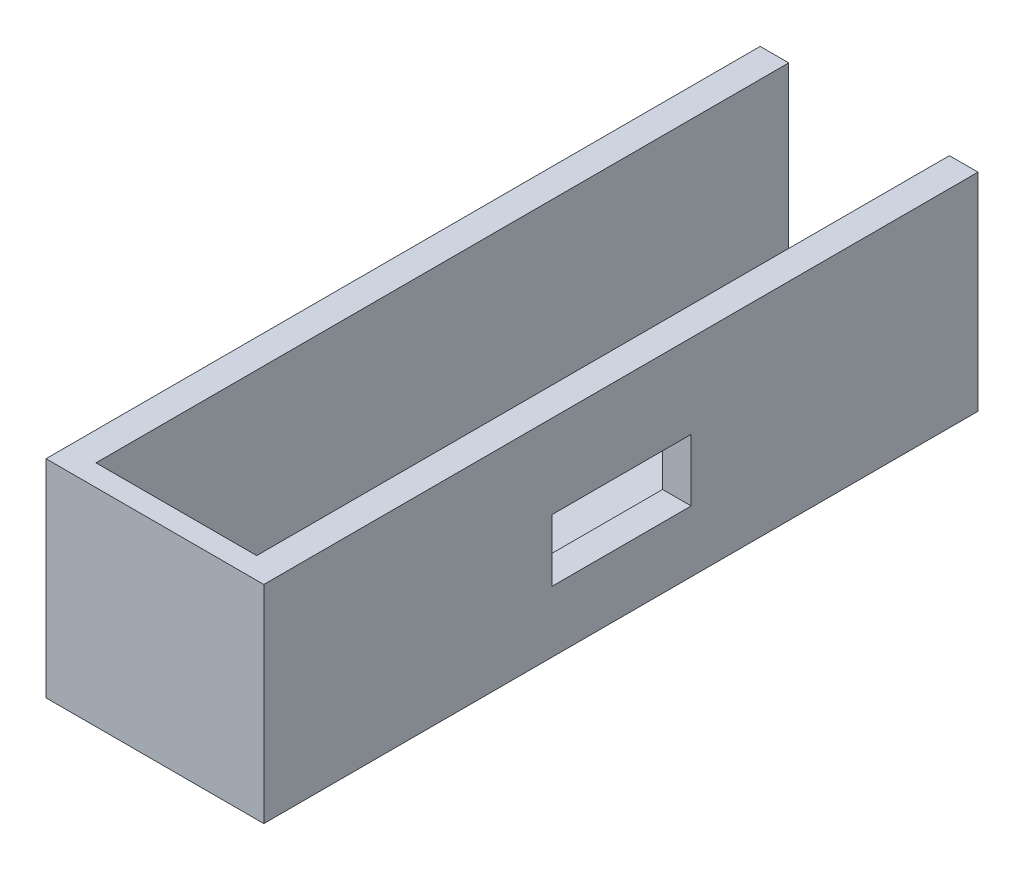
ISO-10303-21;
HEADER;
FILE_DESCRIPTION(('STEP AP214'),'2;1');
FILE_NAME('part.step','',(''),(''),'','','');
FILE_SCHEMA(('AUTOMOTIVE_DESIGN { 1 0 10303 214 1 1 1 1 }'));
ENDSEC;
DATA;
#1=APPLICATION_CONTEXT('core data for automotive mechanical design processes');
#2=APPLICATION_PROTOCOL_DEFINITION('international standard','automotive_design',2000,#1);
#3=PRODUCT_CONTEXT('',#1,'mechanical');
#4=PRODUCT('Part','Part','',(#3));
#5=PRODUCT_RELATED_PRODUCT_CATEGORY('part','',(#4));
#6=PRODUCT_DEFINITION_FORMATION('','',#4);
#7=PRODUCT_DEFINITION_CONTEXT('part definition',#1,'design');
#8=PRODUCT_DEFINITION('design','',#6,#7);
#9=PRODUCT_DEFINITION_SHAPE('','',#8);
#10=(LENGTH_UNIT() NAMED_UNIT(*) SI_UNIT(.MILLI.,.METRE.));
#11=(NAMED_UNIT(*) PLANE_ANGLE_UNIT() SI_UNIT($,.RADIAN.));
#12=(NAMED_UNIT(*) SI_UNIT($,.STERADIAN.) SOLID_ANGLE_UNIT());
#13=UNCERTAINTY_MEASURE_WITH_UNIT(LENGTH_MEASURE(1.E-05),#10,'distance_accuracy_value','');
#14=(GEOMETRIC_REPRESENTATION_CONTEXT(3) GLOBAL_UNCERTAINTY_ASSIGNED_CONTEXT((#13)) GLOBAL_UNIT_ASSIGNED_CONTEXT((#10,
#11,#12)) REPRESENTATION_CONTEXT('',''));
#15=CARTESIAN_POINT('',(0.,0.,0.));
#16=DIRECTION('',(0.,0.,1.));
#17=DIRECTION('',(1.,0.,0.));
#18=AXIS2_PLACEMENT_3D('',#15,#16,#17);
#19=CARTESIAN_POINT('',(12.6513513513514,-25.,50.));
#20=DIRECTION('',(1.,0.,0.));
#21=DIRECTION('',(0.,0.,-1.));
#22=AXIS2_PLACEMENT_3D('',#19,#20,#21);
#23=PLANE('',#22);
#24=DIRECTION('',(0.,-1.,0.));
#25=VECTOR('',#24,1.);
#26=CARTESIAN_POINT('',(12.6513513513514,-25.,47.));
#27=LINE('',#26,#25);
#28=CARTESIAN_POINT('',(12.6513513513514,0.,47.));
#29=VERTEX_POINT('',#28);
#30=CARTESIAN_POINT('',(12.6513513513514,-25.,47.));
#31=VERTEX_POINT('',#30);
#32=EDGE_CURVE('E185',#29,#31,#27,.T.);
#33=ORIENTED_EDGE('',*,*,#32,.F.);
#34=DIRECTION('',(0.,0.,-1.));
#35=VECTOR('',#34,1.);
#36=CARTESIAN_POINT('',(12.6513513513514,0.,50.));
#37=LINE('',#36,#35);
#38=CARTESIAN_POINT('',(12.6513513513514,0.,-50.));
#39=VERTEX_POINT('',#38);
#40=EDGE_CURVE('E151',#29,#39,#37,.T.);
#41=ORIENTED_EDGE('',*,*,#40,.T.);
#42=DIRECTION('',(0.,-1.,0.));
#43=VECTOR('',#42,1.);
#44=CARTESIAN_POINT('',(12.6513513513514,-25.,-50.));
#45=LINE('',#44,#43);
#46=CARTESIAN_POINT('',(12.6513513513514,-25.,-50.));
#47=VERTEX_POINT('',#46);
#48=EDGE_CURVE('E167',#39,#47,#45,.T.);
#49=ORIENTED_EDGE('',*,*,#48,.T.);
#50=DIRECTION('',(0.,0.,-1.));
#51=VECTOR('',#50,1.);
#52=CARTESIAN_POINT('',(12.6513513513514,-25.,50.));
#53=LINE('',#52,#51);
#54=EDGE_CURVE('E153',#31,#47,#53,.T.);
#55=ORIENTED_EDGE('',*,*,#54,.F.);
#56=EDGE_LOOP('',(#33,#41,#49,#55));
#57=FACE_BOUND('',#56,.T.);
#58=DIRECTION('',(0.,-1.,0.));
#59=VECTOR('',#58,1.);
#60=CARTESIAN_POINT('',(12.6513513513514,-25.,-9.83877827761877));
#61=LINE('',#60,#59);
#62=CARTESIAN_POINT('',(12.6513513513514,-11.7079955572935,-9.83877827761876));
#63=VERTEX_POINT('',#62);
#64=CARTESIAN_POINT('',(12.6513513513514,-20.3979955572935,-9.83877827761876));
#65=VERTEX_POINT('',#64);
#66=EDGE_CURVE('E132',#63,#65,#61,.T.);
#67=ORIENTED_EDGE('',*,*,#66,.F.);
#68=DIRECTION('',(0.,0.,-1.));
#69=VECTOR('',#68,1.);
#70=CARTESIAN_POINT('',(12.6513513513514,-11.7079955572935,50.));
#71=LINE('',#70,#69);
#72=CARTESIAN_POINT('',(12.6513513513514,-11.7079955572935,9.66122172238124));
#73=VERTEX_POINT('',#72);
#74=EDGE_CURVE('E201',#73,#63,#71,.T.);
#75=ORIENTED_EDGE('',*,*,#74,.F.);
#76=DIRECTION('',(0.,1.,0.));
#77=VECTOR('',#76,1.);
#78=CARTESIAN_POINT('',(12.6513513513514,-25.,9.66122172238124));
#79=LINE('',#78,#77);
#80=CARTESIAN_POINT('',(12.6513513513514,-20.3979955572935,9.66122172238124));
#81=VERTEX_POINT('',#80);
#82=EDGE_CURVE('E203',#81,#73,#79,.T.);
#83=ORIENTED_EDGE('',*,*,#82,.F.);
#84=DIRECTION('',(0.,0.,1.));
#85=VECTOR('',#84,1.);
#86=CARTESIAN_POINT('',(12.6513513513514,-20.3979955572935,50.));
#87=LINE('',#86,#85);
#88=EDGE_CURVE('E205',#65,#81,#87,.T.);
#89=ORIENTED_EDGE('',*,*,#88,.F.);
#90=EDGE_LOOP('',(#67,#75,#83,#89));
#91=FACE_BOUND('',#90,.T.);
#92=ADVANCED_FACE('F34',(#57,#91),#23,.F.);
#93=CARTESIAN_POINT('',(16.6513513513514,0.,50.));
#94=DIRECTION('',(-1.,0.,0.));
#95=DIRECTION('',(0.,-1.,0.));
#96=AXIS2_PLACEMENT_3D('',#93,#94,#95);
#97=PLANE('',#96);
#98=DIRECTION('',(0.,0.,-1.));
#99=VECTOR('',#98,1.);
#100=CARTESIAN_POINT('',(16.6513513513514,-29.,50.));
#101=LINE('',#100,#99);
#102=CARTESIAN_POINT('',(16.6513513513514,-29.,50.));
#103=VERTEX_POINT('',#102);
#104=CARTESIAN_POINT('',(16.6513513513514,-29.,-50.));
#105=VERTEX_POINT('',#104);
#106=EDGE_CURVE('E147',#103,#105,#101,.T.);
#107=ORIENTED_EDGE('',*,*,#106,.T.);
#108=DIRECTION('',(0.,1.,0.));
#109=VECTOR('',#108,1.);
#110=CARTESIAN_POINT('',(16.6513513513514,0.,-50.));
#111=LINE('',#110,#109);
#112=CARTESIAN_POINT('',(16.6513513513514,0.,-50.));
#113=VERTEX_POINT('',#112);
#114=EDGE_CURVE('E173',#105,#113,#111,.T.);
#115=ORIENTED_EDGE('',*,*,#114,.T.);
#116=DIRECTION('',(0.,0.,-1.));
#117=VECTOR('',#116,1.);
#118=CARTESIAN_POINT('',(16.6513513513514,0.,50.));
#119=LINE('',#118,#117);
#120=CARTESIAN_POINT('',(16.6513513513514,0.,50.));
#121=VERTEX_POINT('',#120);
#122=EDGE_CURVE('E149',#121,#113,#119,.T.);
#123=ORIENTED_EDGE('',*,*,#122,.F.);
#124=DIRECTION('',(0.,1.,0.));
#125=VECTOR('',#124,1.);
#126=CARTESIAN_POINT('',(16.6513513513514,0.,50.));
#127=LINE('',#126,#125);
#128=EDGE_CURVE('E159',#103,#121,#127,.T.);
#129=ORIENTED_EDGE('',*,*,#128,.F.);
#130=EDGE_LOOP('',(#107,#115,#123,#129));
#131=FACE_BOUND('',#130,.T.);
#132=DIRECTION('',(0.,1.,0.));
#133=VECTOR('',#132,1.);
#134=CARTESIAN_POINT('',(16.6513513513514,0.,-9.83877827761877));
#135=LINE('',#134,#133);
#136=CARTESIAN_POINT('',(16.6513513513514,-20.3979955572935,-9.83877827761876));
#137=VERTEX_POINT('',#136);
#138=CARTESIAN_POINT('',(16.6513513513514,-11.7079955572935,-9.83877827761876));
#139=VERTEX_POINT('',#138);
#140=EDGE_CURVE('E11',#137,#139,#135,.T.);
#141=ORIENTED_EDGE('',*,*,#140,.F.);
#142=DIRECTION('',(0.,0.,-1.));
#143=VECTOR('',#142,1.);
#144=CARTESIAN_POINT('',(16.6513513513514,-20.3979955572935,50.));
#145=LINE('',#144,#143);
#146=CARTESIAN_POINT('',(16.6513513513514,-20.3979955572935,9.66122172238124));
#147=VERTEX_POINT('',#146);
#148=EDGE_CURVE('E119',#147,#137,#145,.T.);
#149=ORIENTED_EDGE('',*,*,#148,.F.);
#150=DIRECTION('',(0.,-1.,0.));
#151=VECTOR('',#150,1.);
#152=CARTESIAN_POINT('',(16.6513513513514,0.,9.66122172238124));
#153=LINE('',#152,#151);
#154=CARTESIAN_POINT('',(16.6513513513514,-11.7079955572935,9.66122172238124));
#155=VERTEX_POINT('',#154);
#156=EDGE_CURVE('E124',#155,#147,#153,.T.);
#157=ORIENTED_EDGE('',*,*,#156,.F.);
#158=DIRECTION('',(0.,0.,1.));
#159=VECTOR('',#158,1.);
#160=CARTESIAN_POINT('',(16.6513513513514,-11.7079955572935,50.));
#161=LINE('',#160,#159);
#162=EDGE_CURVE('E42',#139,#155,#161,.T.);
#163=ORIENTED_EDGE('',*,*,#162,.F.);
#164=EDGE_LOOP('',(#141,#149,#157,#163));
#165=FACE_BOUND('',#164,.T.);
#166=ADVANCED_FACE('F136',(#131,#165),#97,.F.);
#167=CARTESIAN_POINT('',(-9.84864864864863,-25.,50.));
#168=DIRECTION('',(0.,-1.,0.));
#169=DIRECTION('',(0.,0.,-1.));
#170=AXIS2_PLACEMENT_3D('',#167,#168,#169);
#171=PLANE('',#170);
#172=DIRECTION('',(-1.,0.,0.));
#173=VECTOR('',#172,1.);
#174=CARTESIAN_POINT('',(-9.84864864864863,-25.,47.));
#175=LINE('',#174,#173);
#176=CARTESIAN_POINT('',(-9.84864864864863,-25.,47.));
#177=VERTEX_POINT('',#176);
#178=EDGE_CURVE('E195',#31,#177,#175,.T.);
#179=ORIENTED_EDGE('',*,*,#178,.F.);
#180=ORIENTED_EDGE('',*,*,#54,.T.);
#181=DIRECTION('',(-1.,0.,0.));
#182=VECTOR('',#181,1.);
#183=CARTESIAN_POINT('',(-9.84864864864863,-25.,-50.));
#184=LINE('',#183,#182);
#185=CARTESIAN_POINT('',(-9.84864864864863,-25.,-50.));
#186=VERTEX_POINT('',#185);
#187=EDGE_CURVE('E164',#47,#186,#184,.T.);
#188=ORIENTED_EDGE('',*,*,#187,.T.);
#189=DIRECTION('',(0.,0.,-1.));
#190=VECTOR('',#189,1.);
#191=CARTESIAN_POINT('',(-9.84864864864863,-25.,50.));
#192=LINE('',#191,#190);
#193=EDGE_CURVE('E155',#177,#186,#192,.T.);
#194=ORIENTED_EDGE('',*,*,#193,.F.);
#195=EDGE_LOOP('',(#179,#180,#188,#194));
#196=FACE_BOUND('',#195,.T.);
#197=ADVANCED_FACE('F232',(#196),#171,.F.);
#198=CARTESIAN_POINT('',(-9.84864864864864,0.,50.));
#199=DIRECTION('',(-1.,0.,0.));
#200=DIRECTION('',(0.,-1.,0.));
#201=AXIS2_PLACEMENT_3D('',#198,#199,#200);
#202=PLANE('',#201);
#203=DIRECTION('',(0.,1.,0.));
#204=VECTOR('',#203,1.);
#205=CARTESIAN_POINT('',(-9.84864864864864,0.,47.));
#206=LINE('',#205,#204);
#207=CARTESIAN_POINT('',(-9.84864864864864,0.,47.));
#208=VERTEX_POINT('',#207);
#209=EDGE_CURVE('E125',#177,#208,#206,.T.);
#210=ORIENTED_EDGE('',*,*,#209,.F.);
#211=ORIENTED_EDGE('',*,*,#193,.T.);
#212=DIRECTION('',(0.,1.,0.));
#213=VECTOR('',#212,1.);
#214=CARTESIAN_POINT('',(-9.84864864864864,0.,-50.));
#215=LINE('',#214,#213);
#216=CARTESIAN_POINT('',(-9.84864864864864,0.,-50.));
#217=VERTEX_POINT('',#216);
#218=EDGE_CURVE('E160',#186,#217,#215,.T.);
#219=ORIENTED_EDGE('',*,*,#218,.T.);
#220=DIRECTION('',(0.,0.,-1.));
#221=VECTOR('',#220,1.);
#222=CARTESIAN_POINT('',(-9.84864864864864,0.,50.));
#223=LINE('',#222,#221);
#224=EDGE_CURVE('E157',#208,#217,#223,.T.);
#225=ORIENTED_EDGE('',*,*,#224,.F.);
#226=EDGE_LOOP('',(#210,#211,#219,#225));
#227=FACE_BOUND('',#226,.T.);
#228=ADVANCED_FACE('F249',(#227),#202,.F.);
#229=CARTESIAN_POINT('',(-13.8486486486486,-29.,50.));
#230=DIRECTION('',(1.,0.,0.));
#231=DIRECTION('',(0.,1.,0.));
#232=AXIS2_PLACEMENT_3D('',#229,#230,#231);
#233=PLANE('',#232);
#234=DIRECTION('',(0.,0.,-1.));
#235=VECTOR('',#234,1.);
#236=CARTESIAN_POINT('',(-13.8486486486486,0.,50.));
#237=LINE('',#236,#235);
#238=CARTESIAN_POINT('',(-13.8486486486486,0.,50.));
#239=VERTEX_POINT('',#238);
#240=CARTESIAN_POINT('',(-13.8486486486486,0.,-50.));
#241=VERTEX_POINT('',#240);
#242=EDGE_CURVE('E143',#239,#241,#237,.T.);
#243=ORIENTED_EDGE('',*,*,#242,.T.);
#244=DIRECTION('',(0.,-1.,0.));
#245=VECTOR('',#244,1.);
#246=CARTESIAN_POINT('',(-13.8486486486486,-29.,-50.));
#247=LINE('',#246,#245);
#248=CARTESIAN_POINT('',(-13.8486486486486,-29.,-50.));
#249=VERTEX_POINT('',#248);
#250=EDGE_CURVE('E179',#241,#249,#247,.T.);
#251=ORIENTED_EDGE('',*,*,#250,.T.);
#252=DIRECTION('',(0.,0.,-1.));
#253=VECTOR('',#252,1.);
#254=CARTESIAN_POINT('',(-13.8486486486486,-29.,50.));
#255=LINE('',#254,#253);
#256=CARTESIAN_POINT('',(-13.8486486486486,-29.,50.));
#257=VERTEX_POINT('',#256);
#258=EDGE_CURVE('E145',#257,#249,#255,.T.);
#259=ORIENTED_EDGE('',*,*,#258,.F.);
#260=DIRECTION('',(0.,-1.,0.));
#261=VECTOR('',#260,1.);
#262=CARTESIAN_POINT('',(-13.8486486486486,-29.,50.));
#263=LINE('',#262,#261);
#264=EDGE_CURVE('E190',#239,#257,#263,.T.);
#265=ORIENTED_EDGE('',*,*,#264,.F.);
#266=EDGE_LOOP('',(#243,#251,#259,#265));
#267=FACE_BOUND('',#266,.T.);
#268=ADVANCED_FACE('F36',(#267),#233,.F.);
#269=CARTESIAN_POINT('',(16.6513513513514,-29.,50.));
#270=DIRECTION('',(0.,1.,0.));
#271=DIRECTION('',(-1.,0.,0.));
#272=AXIS2_PLACEMENT_3D('',#269,#270,#271);
#273=PLANE('',#272);
#274=ORIENTED_EDGE('',*,*,#258,.T.);
#275=DIRECTION('',(1.,0.,0.));
#276=VECTOR('',#275,1.);
#277=CARTESIAN_POINT('',(16.6513513513514,-29.,-50.));
#278=LINE('',#277,#276);
#279=EDGE_CURVE('E176',#249,#105,#278,.T.);
#280=ORIENTED_EDGE('',*,*,#279,.T.);
#281=ORIENTED_EDGE('',*,*,#106,.F.);
#282=DIRECTION('',(1.,0.,0.));
#283=VECTOR('',#282,1.);
#284=CARTESIAN_POINT('',(16.6513513513514,-29.,50.));
#285=LINE('',#284,#283);
#286=EDGE_CURVE('E188',#257,#103,#285,.T.);
#287=ORIENTED_EDGE('',*,*,#286,.F.);
#288=EDGE_LOOP('',(#274,#280,#281,#287));
#289=FACE_BOUND('',#288,.T.);
#290=ADVANCED_FACE('F242',(#289),#273,.F.);
#291=CARTESIAN_POINT('',(12.6513513513514,0.,50.));
#292=DIRECTION('',(0.,-1.,0.));
#293=DIRECTION('',(0.,0.,-1.));
#294=AXIS2_PLACEMENT_3D('',#291,#292,#293);
#295=PLANE('',#294);
#296=ORIENTED_EDGE('',*,*,#122,.T.);
#297=DIRECTION('',(-1.,0.,0.));
#298=VECTOR('',#297,1.);
#299=CARTESIAN_POINT('',(12.6513513513514,0.,-50.));
#300=LINE('',#299,#298);
#301=EDGE_CURVE('E170',#113,#39,#300,.T.);
#302=ORIENTED_EDGE('',*,*,#301,.T.);
#303=ORIENTED_EDGE('',*,*,#40,.F.);
#304=DIRECTION('',(-1.,0.,0.));
#305=VECTOR('',#304,1.);
#306=CARTESIAN_POINT('',(-13.8486486486486,0.,47.));
#307=LINE('',#306,#305);
#308=EDGE_CURVE('E197',#29,#208,#307,.T.);
#309=ORIENTED_EDGE('',*,*,#308,.T.);
#310=ORIENTED_EDGE('',*,*,#224,.T.);
#311=DIRECTION('',(-1.,0.,0.));
#312=VECTOR('',#311,1.);
#313=CARTESIAN_POINT('',(-13.8486486486486,0.,-50.));
#314=LINE('',#313,#312);
#315=EDGE_CURVE('E182',#217,#241,#314,.T.);
#316=ORIENTED_EDGE('',*,*,#315,.T.);
#317=ORIENTED_EDGE('',*,*,#242,.F.);
#318=DIRECTION('',(-1.,0.,0.));
#319=VECTOR('',#318,1.);
#320=CARTESIAN_POINT('',(-13.8486486486486,0.,50.));
#321=LINE('',#320,#319);
#322=EDGE_CURVE('E163',#121,#239,#321,.T.);
#323=ORIENTED_EDGE('',*,*,#322,.F.);
#324=EDGE_LOOP('',(#296,#302,#303,#309,#310,#316,#317,#323));
#325=FACE_BOUND('',#324,.T.);
#326=ADVANCED_FACE('F239',(#325),#295,.F.);
#327=CARTESIAN_POINT('',(0.,0.,50.));
#328=DIRECTION('',(0.,0.,-1.));
#329=DIRECTION('',(-1.,0.,0.));
#330=AXIS2_PLACEMENT_3D('',#327,#328,#329);
#331=PLANE('',#330);
#332=ORIENTED_EDGE('',*,*,#322,.T.);
#333=ORIENTED_EDGE('',*,*,#264,.T.);
#334=ORIENTED_EDGE('',*,*,#286,.T.);
#335=ORIENTED_EDGE('',*,*,#128,.T.);
#336=EDGE_LOOP('',(#332,#333,#334,#335));
#337=FACE_BOUND('',#336,.T.);
#338=ADVANCED_FACE('F241',(#337),#331,.F.);
#339=CARTESIAN_POINT('',(0.,0.,-50.));
#340=DIRECTION('',(0.,0.,-1.));
#341=DIRECTION('',(-1.,0.,0.));
#342=AXIS2_PLACEMENT_3D('',#339,#340,#341);
#343=PLANE('',#342);
#344=ORIENTED_EDGE('',*,*,#315,.F.);
#345=ORIENTED_EDGE('',*,*,#218,.F.);
#346=ORIENTED_EDGE('',*,*,#187,.F.);
#347=ORIENTED_EDGE('',*,*,#48,.F.);
#348=ORIENTED_EDGE('',*,*,#301,.F.);
#349=ORIENTED_EDGE('',*,*,#114,.F.);
#350=ORIENTED_EDGE('',*,*,#279,.F.);
#351=ORIENTED_EDGE('',*,*,#250,.F.);
#352=EDGE_LOOP('',(#344,#345,#346,#347,#348,#349,#350,#351));
#353=FACE_BOUND('',#352,.T.);
#354=ADVANCED_FACE('F260',(#353),#343,.T.);
#355=CARTESIAN_POINT('',(0.,0.,47.));
#356=DIRECTION('',(0.,0.,1.));
#357=DIRECTION('',(1.,0.,0.));
#358=AXIS2_PLACEMENT_3D('',#355,#356,#357);
#359=PLANE('',#358);
#360=ORIENTED_EDGE('',*,*,#308,.F.);
#361=ORIENTED_EDGE('',*,*,#32,.T.);
#362=ORIENTED_EDGE('',*,*,#178,.T.);
#363=ORIENTED_EDGE('',*,*,#209,.T.);
#364=EDGE_LOOP('',(#360,#361,#362,#363));
#365=FACE_BOUND('',#364,.T.);
#366=ADVANCED_FACE('F224',(#365),#359,.F.);
#367=CARTESIAN_POINT('',(30.,-20.3979955572935,-9.83877827761876));
#368=DIRECTION('',(0.,0.,1.));
#369=DIRECTION('',(1.,0.,0.));
#370=AXIS2_PLACEMENT_3D('',#367,#368,#369);
#371=PLANE('',#370);
#372=ORIENTED_EDGE('',*,*,#66,.T.);
#373=DIRECTION('',(-1.,0.,0.));
#374=VECTOR('',#373,1.);
#375=CARTESIAN_POINT('',(30.,-20.3979955572935,-9.83877827761876));
#376=LINE('',#375,#374);
#377=EDGE_CURVE('E49',#137,#65,#376,.T.);
#378=ORIENTED_EDGE('',*,*,#377,.F.);
#379=ORIENTED_EDGE('',*,*,#140,.T.);
#380=DIRECTION('',(-1.,0.,0.));
#381=VECTOR('',#380,1.);
#382=CARTESIAN_POINT('',(30.,-11.7079955572935,-9.83877827761876));
#383=LINE('',#382,#381);
#384=EDGE_CURVE('E207',#139,#63,#383,.T.);
#385=ORIENTED_EDGE('',*,*,#384,.T.);
#386=EDGE_LOOP('',(#372,#378,#379,#385));
#387=FACE_BOUND('',#386,.T.);
#388=ADVANCED_FACE('F128',(#387),#371,.T.);
#389=CARTESIAN_POINT('',(30.,-11.7079955572935,9.66122172238124));
#390=DIRECTION('',(0.,-1.,0.));
#391=DIRECTION('',(0.,0.,-1.));
#392=AXIS2_PLACEMENT_3D('',#389,#390,#391);
#393=PLANE('',#392);
#394=ORIENTED_EDGE('',*,*,#74,.T.);
#395=ORIENTED_EDGE('',*,*,#384,.F.);
#396=ORIENTED_EDGE('',*,*,#162,.T.);
#397=DIRECTION('',(-1.,0.,0.));
#398=VECTOR('',#397,1.);
#399=CARTESIAN_POINT('',(30.,-11.7079955572935,9.66122172238124));
#400=LINE('',#399,#398);
#401=EDGE_CURVE('E209',#155,#73,#400,.T.);
#402=ORIENTED_EDGE('',*,*,#401,.T.);
#403=EDGE_LOOP('',(#394,#395,#396,#402));
#404=FACE_BOUND('',#403,.T.);
#405=ADVANCED_FACE('F216',(#404),#393,.T.);
#406=CARTESIAN_POINT('',(30.,-20.3979955572935,9.66122172238124));
#407=DIRECTION('',(0.,0.,-1.));
#408=DIRECTION('',(-1.,0.,0.));
#409=AXIS2_PLACEMENT_3D('',#406,#407,#408);
#410=PLANE('',#409);
#411=ORIENTED_EDGE('',*,*,#82,.T.);
#412=ORIENTED_EDGE('',*,*,#401,.F.);
#413=ORIENTED_EDGE('',*,*,#156,.T.);
#414=DIRECTION('',(-1.,0.,0.));
#415=VECTOR('',#414,1.);
#416=CARTESIAN_POINT('',(30.,-20.3979955572935,9.66122172238124));
#417=LINE('',#416,#415);
#418=EDGE_CURVE('E54',#147,#81,#417,.T.);
#419=ORIENTED_EDGE('',*,*,#418,.T.);
#420=EDGE_LOOP('',(#411,#412,#413,#419));
#421=FACE_BOUND('',#420,.T.);
#422=ADVANCED_FACE('F213',(#421),#410,.T.);
#423=CARTESIAN_POINT('',(30.,-20.3979955572935,9.66122172238124));
#424=DIRECTION('',(0.,1.,0.));
#425=DIRECTION('',(0.,0.,1.));
#426=AXIS2_PLACEMENT_3D('',#423,#424,#425);
#427=PLANE('',#426);
#428=ORIENTED_EDGE('',*,*,#88,.T.);
#429=ORIENTED_EDGE('',*,*,#418,.F.);
#430=ORIENTED_EDGE('',*,*,#148,.T.);
#431=ORIENTED_EDGE('',*,*,#377,.T.);
#432=EDGE_LOOP('',(#428,#429,#430,#431));
#433=FACE_BOUND('',#432,.T.);
#434=ADVANCED_FACE('F120',(#433),#427,.T.);
#435=CLOSED_SHELL('',(#92,#166,#197,#228,#268,#290,#326,#338,#354,#366,#388,#405,#422,#434));
#436=MANIFOLD_SOLID_BREP('B2',#435);
#437=ADVANCED_BREP_SHAPE_REPRESENTATION('',(#18,#436),#14);
#438=SHAPE_DEFINITION_REPRESENTATION(#9,#437);
ENDSEC;
END-ISO-10303-21;
